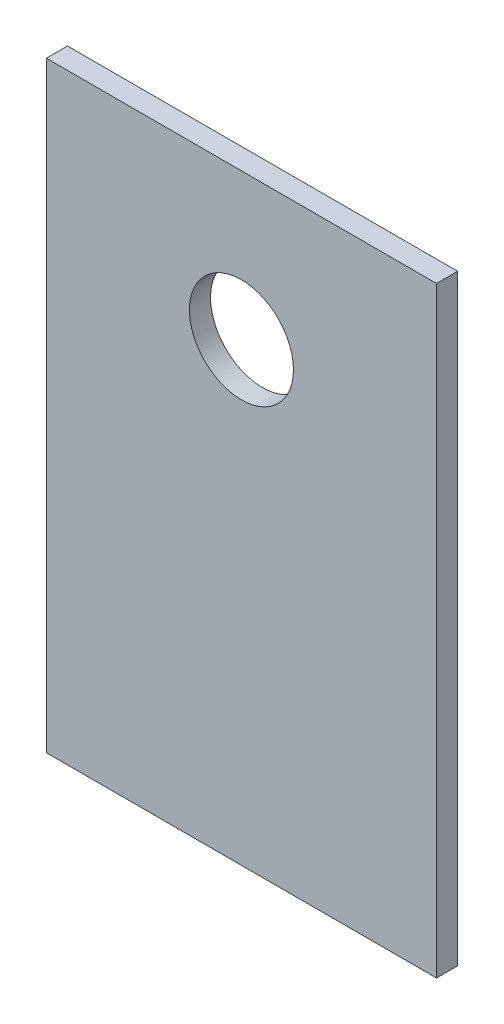
ISO-10303-21;
HEADER;
FILE_DESCRIPTION(('STEP AP214'),'2;1');
FILE_NAME('part.step','',(''),(''),'','','');
FILE_SCHEMA(('AUTOMOTIVE_DESIGN { 1 0 10303 214 1 1 1 1 }'));
ENDSEC;
DATA;
#1=APPLICATION_CONTEXT('core data for automotive mechanical design processes');
#2=APPLICATION_PROTOCOL_DEFINITION('international standard','automotive_design',2000,#1);
#3=PRODUCT_CONTEXT('',#1,'mechanical');
#4=PRODUCT('Part','Part','',(#3));
#5=PRODUCT_RELATED_PRODUCT_CATEGORY('part','',(#4));
#6=PRODUCT_DEFINITION_FORMATION('','',#4);
#7=PRODUCT_DEFINITION_CONTEXT('part definition',#1,'design');
#8=PRODUCT_DEFINITION('design','',#6,#7);
#9=PRODUCT_DEFINITION_SHAPE('','',#8);
#10=(LENGTH_UNIT() NAMED_UNIT(*) SI_UNIT(.MILLI.,.METRE.));
#11=(NAMED_UNIT(*) PLANE_ANGLE_UNIT() SI_UNIT($,.RADIAN.));
#12=(NAMED_UNIT(*) SI_UNIT($,.STERADIAN.) SOLID_ANGLE_UNIT());
#13=UNCERTAINTY_MEASURE_WITH_UNIT(LENGTH_MEASURE(1.E-05),#10,'distance_accuracy_value','');
#14=(GEOMETRIC_REPRESENTATION_CONTEXT(3) GLOBAL_UNCERTAINTY_ASSIGNED_CONTEXT((#13)) GLOBAL_UNIT_ASSIGNED_CONTEXT((#10,
#11,#12)) REPRESENTATION_CONTEXT('',''));
#15=CARTESIAN_POINT('',(0.,0.,0.));
#16=DIRECTION('',(0.,0.,1.));
#17=DIRECTION('',(1.,0.,0.));
#18=AXIS2_PLACEMENT_3D('',#15,#16,#17);
#19=CARTESIAN_POINT('',(0.,0.,0.65));
#20=DIRECTION('',(0.,0.,-1.));
#21=DIRECTION('',(-1.,0.,0.));
#22=AXIS2_PLACEMENT_3D('',#19,#20,#21);
#23=PLANE('',#22);
#24=DIRECTION('',(0.,-1.,0.));
#25=VECTOR('',#24,1.);
#26=CARTESIAN_POINT('',(-6.,-14.,0.65));
#27=LINE('',#26,#25);
#28=CARTESIAN_POINT('',(-6.,4.5,0.65));
#29=VERTEX_POINT('',#28);
#30=CARTESIAN_POINT('',(-6.,-14.,0.65));
#31=VERTEX_POINT('',#30);
#32=EDGE_CURVE('E86',#29,#31,#27,.T.);
#33=ORIENTED_EDGE('',*,*,#32,.T.);
#34=DIRECTION('',(1.,0.,0.));
#35=VECTOR('',#34,1.);
#36=CARTESIAN_POINT('',(-6.,-14.,0.65));
#37=LINE('',#36,#35);
#38=CARTESIAN_POINT('',(6.,-14.,0.65));
#39=VERTEX_POINT('',#38);
#40=EDGE_CURVE('E81',#31,#39,#37,.T.);
#41=ORIENTED_EDGE('',*,*,#40,.T.);
#42=DIRECTION('',(0.,1.,0.));
#43=VECTOR('',#42,1.);
#44=CARTESIAN_POINT('',(6.,-14.,0.65));
#45=LINE('',#44,#43);
#46=CARTESIAN_POINT('',(6.,4.5,0.65));
#47=VERTEX_POINT('',#46);
#48=EDGE_CURVE('E84',#39,#47,#45,.T.);
#49=ORIENTED_EDGE('',*,*,#48,.T.);
#50=DIRECTION('',(-1.,0.,0.));
#51=VECTOR('',#50,1.);
#52=CARTESIAN_POINT('',(-6.,4.5,0.65));
#53=LINE('',#52,#51);
#54=EDGE_CURVE('E51',#47,#29,#53,.T.);
#55=ORIENTED_EDGE('',*,*,#54,.T.);
#56=EDGE_LOOP('',(#33,#41,#49,#55));
#57=FACE_BOUND('',#56,.T.);
#58=CARTESIAN_POINT('',(0.,0.,0.65));
#59=DIRECTION('',(0.,0.,1.));
#60=DIRECTION('',(1.,0.,0.));
#61=AXIS2_PLACEMENT_3D('',#58,#59,#60);
#62=CIRCLE('',#61,1.6);
#63=CARTESIAN_POINT('',(1.6,0.,0.65));
#64=VERTEX_POINT('',#63);
#65=EDGE_CURVE('E101',#64,#64,#62,.T.);
#66=ORIENTED_EDGE('',*,*,#65,.F.);
#67=EDGE_LOOP('',(#66));
#68=FACE_BOUND('',#67,.T.);
#69=ADVANCED_FACE('F34',(#57,#68),#23,.F.);
#70=CARTESIAN_POINT('',(0.,0.,0.));
#71=DIRECTION('',(0.,0.,-1.));
#72=DIRECTION('',(-1.,0.,0.));
#73=AXIS2_PLACEMENT_3D('',#70,#71,#72);
#74=PLANE('',#73);
#75=DIRECTION('',(0.,-1.,0.));
#76=VECTOR('',#75,1.);
#77=CARTESIAN_POINT('',(-6.,-14.,0.));
#78=LINE('',#77,#76);
#79=CARTESIAN_POINT('',(-6.,4.5,0.));
#80=VERTEX_POINT('',#79);
#81=CARTESIAN_POINT('',(-6.,-14.,0.));
#82=VERTEX_POINT('',#81);
#83=EDGE_CURVE('E98',#80,#82,#78,.T.);
#84=ORIENTED_EDGE('',*,*,#83,.F.);
#85=DIRECTION('',(-1.,0.,0.));
#86=VECTOR('',#85,1.);
#87=CARTESIAN_POINT('',(-6.,4.5,0.));
#88=LINE('',#87,#86);
#89=CARTESIAN_POINT('',(6.,4.5,0.));
#90=VERTEX_POINT('',#89);
#91=EDGE_CURVE('E74',#90,#80,#88,.T.);
#92=ORIENTED_EDGE('',*,*,#91,.F.);
#93=DIRECTION('',(0.,1.,0.));
#94=VECTOR('',#93,1.);
#95=CARTESIAN_POINT('',(6.,-14.,0.));
#96=LINE('',#95,#94);
#97=CARTESIAN_POINT('',(6.,-14.,0.));
#98=VERTEX_POINT('',#97);
#99=EDGE_CURVE('E68',#98,#90,#96,.T.);
#100=ORIENTED_EDGE('',*,*,#99,.F.);
#101=DIRECTION('',(1.,0.,0.));
#102=VECTOR('',#101,1.);
#103=CARTESIAN_POINT('',(-6.,-14.,0.));
#104=LINE('',#103,#102);
#105=EDGE_CURVE('E90',#82,#98,#104,.T.);
#106=ORIENTED_EDGE('',*,*,#105,.F.);
#107=EDGE_LOOP('',(#84,#92,#100,#106));
#108=FACE_BOUND('',#107,.T.);
#109=CARTESIAN_POINT('',(0.,0.,0.));
#110=DIRECTION('',(0.,0.,1.));
#111=DIRECTION('',(1.,0.,0.));
#112=AXIS2_PLACEMENT_3D('',#109,#110,#111);
#113=CIRCLE('',#112,1.6);
#114=CARTESIAN_POINT('',(1.6,0.,0.));
#115=VERTEX_POINT('',#114);
#116=EDGE_CURVE('E113',#115,#115,#113,.T.);
#117=ORIENTED_EDGE('',*,*,#116,.T.);
#118=EDGE_LOOP('',(#117));
#119=FACE_BOUND('',#118,.T.);
#120=ADVANCED_FACE('F109',(#108,#119),#74,.T.);
#121=CARTESIAN_POINT('',(-6.,-14.,0.65));
#122=DIRECTION('',(1.,0.,0.));
#123=DIRECTION('',(0.,0.,-1.));
#124=AXIS2_PLACEMENT_3D('',#121,#122,#123);
#125=PLANE('',#124);
#126=ORIENTED_EDGE('',*,*,#83,.T.);
#127=DIRECTION('',(0.,0.,-1.));
#128=VECTOR('',#127,1.);
#129=CARTESIAN_POINT('',(-6.,-14.,0.65));
#130=LINE('',#129,#128);
#131=EDGE_CURVE('E11',#31,#82,#130,.T.);
#132=ORIENTED_EDGE('',*,*,#131,.F.);
#133=ORIENTED_EDGE('',*,*,#32,.F.);
#134=DIRECTION('',(0.,0.,-1.));
#135=VECTOR('',#134,1.);
#136=CARTESIAN_POINT('',(-6.,4.5,0.65));
#137=LINE('',#136,#135);
#138=EDGE_CURVE('E94',#29,#80,#137,.T.);
#139=ORIENTED_EDGE('',*,*,#138,.T.);
#140=EDGE_LOOP('',(#126,#132,#133,#139));
#141=FACE_BOUND('',#140,.T.);
#142=ADVANCED_FACE('F36',(#141),#125,.F.);
#143=CARTESIAN_POINT('',(-6.,-14.,0.65));
#144=DIRECTION('',(0.,1.,0.));
#145=DIRECTION('',(0.,0.,1.));
#146=AXIS2_PLACEMENT_3D('',#143,#144,#145);
#147=PLANE('',#146);
#148=ORIENTED_EDGE('',*,*,#105,.T.);
#149=DIRECTION('',(0.,0.,-1.));
#150=VECTOR('',#149,1.);
#151=CARTESIAN_POINT('',(6.,-14.,0.65));
#152=LINE('',#151,#150);
#153=EDGE_CURVE('E43',#39,#98,#152,.T.);
#154=ORIENTED_EDGE('',*,*,#153,.F.);
#155=ORIENTED_EDGE('',*,*,#40,.F.);
#156=ORIENTED_EDGE('',*,*,#131,.T.);
#157=EDGE_LOOP('',(#148,#154,#155,#156));
#158=FACE_BOUND('',#157,.T.);
#159=ADVANCED_FACE('F89',(#158),#147,.F.);
#160=CARTESIAN_POINT('',(6.,-14.,0.65));
#161=DIRECTION('',(-1.,0.,0.));
#162=DIRECTION('',(0.,0.,1.));
#163=AXIS2_PLACEMENT_3D('',#160,#161,#162);
#164=PLANE('',#163);
#165=ORIENTED_EDGE('',*,*,#99,.T.);
#166=DIRECTION('',(0.,0.,-1.));
#167=VECTOR('',#166,1.);
#168=CARTESIAN_POINT('',(6.,4.5,0.65));
#169=LINE('',#168,#167);
#170=EDGE_CURVE('E91',#47,#90,#169,.T.);
#171=ORIENTED_EDGE('',*,*,#170,.F.);
#172=ORIENTED_EDGE('',*,*,#48,.F.);
#173=ORIENTED_EDGE('',*,*,#153,.T.);
#174=EDGE_LOOP('',(#165,#171,#172,#173));
#175=FACE_BOUND('',#174,.T.);
#176=ADVANCED_FACE('F92',(#175),#164,.F.);
#177=CARTESIAN_POINT('',(-6.,4.5,0.65));
#178=DIRECTION('',(0.,-1.,0.));
#179=DIRECTION('',(0.,0.,-1.));
#180=AXIS2_PLACEMENT_3D('',#177,#178,#179);
#181=PLANE('',#180);
#182=ORIENTED_EDGE('',*,*,#91,.T.);
#183=ORIENTED_EDGE('',*,*,#138,.F.);
#184=ORIENTED_EDGE('',*,*,#54,.F.);
#185=ORIENTED_EDGE('',*,*,#170,.T.);
#186=EDGE_LOOP('',(#182,#183,#184,#185));
#187=FACE_BOUND('',#186,.T.);
#188=ADVANCED_FACE('F106',(#187),#181,.F.);
#189=CARTESIAN_POINT('',(0.,0.,0.65));
#190=DIRECTION('',(0.,0.,-1.));
#191=DIRECTION('',(-1.,0.,0.));
#192=AXIS2_PLACEMENT_3D('',#189,#190,#191);
#193=CYLINDRICAL_SURFACE('',#192,1.6);
#194=ORIENTED_EDGE('',*,*,#65,.T.);
#195=EDGE_LOOP('',(#194));
#196=FACE_BOUND('',#195,.T.);
#197=ORIENTED_EDGE('',*,*,#116,.F.);
#198=EDGE_LOOP('',(#197));
#199=FACE_BOUND('',#198,.T.);
#200=ADVANCED_FACE('F119',(#196,#199),#193,.F.);
#201=CLOSED_SHELL('',(#69,#120,#142,#159,#176,#188,#200));
#202=MANIFOLD_SOLID_BREP('B2',#201);
#203=ADVANCED_BREP_SHAPE_REPRESENTATION('',(#18,#202),#14);
#204=SHAPE_DEFINITION_REPRESENTATION(#9,#203);
ENDSEC;
END-ISO-10303-21;
